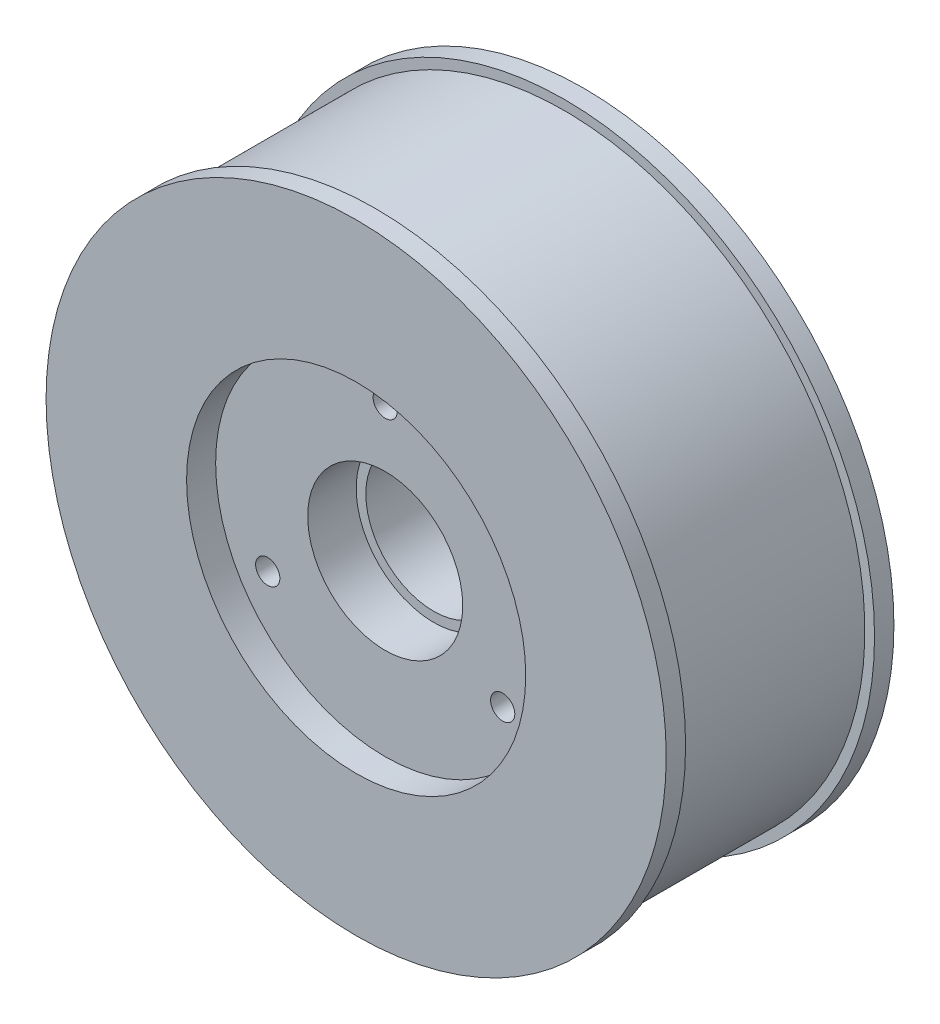
ISO-10303-21;
HEADER;
FILE_DESCRIPTION(('STEP AP214'),'2;1');
FILE_NAME('part.step','',(''),(''),'','','');
FILE_SCHEMA(('AUTOMOTIVE_DESIGN { 1 0 10303 214 1 1 1 1 }'));
ENDSEC;
DATA;
#1=APPLICATION_CONTEXT('core data for automotive mechanical design processes');
#2=APPLICATION_PROTOCOL_DEFINITION('international standard','automotive_design',2000,#1);
#3=PRODUCT_CONTEXT('',#1,'mechanical');
#4=PRODUCT('Part','Part','',(#3));
#5=PRODUCT_RELATED_PRODUCT_CATEGORY('part','',(#4));
#6=PRODUCT_DEFINITION_FORMATION('','',#4);
#7=PRODUCT_DEFINITION_CONTEXT('part definition',#1,'design');
#8=PRODUCT_DEFINITION('design','',#6,#7);
#9=PRODUCT_DEFINITION_SHAPE('','',#8);
#10=(LENGTH_UNIT() NAMED_UNIT(*) SI_UNIT(.MILLI.,.METRE.));
#11=(NAMED_UNIT(*) PLANE_ANGLE_UNIT() SI_UNIT($,.RADIAN.));
#12=(NAMED_UNIT(*) SI_UNIT($,.STERADIAN.) SOLID_ANGLE_UNIT());
#13=UNCERTAINTY_MEASURE_WITH_UNIT(LENGTH_MEASURE(1.E-05),#10,'distance_accuracy_value','');
#14=(GEOMETRIC_REPRESENTATION_CONTEXT(3) GLOBAL_UNCERTAINTY_ASSIGNED_CONTEXT((#13)) GLOBAL_UNIT_ASSIGNED_CONTEXT((#10,
#11,#12)) REPRESENTATION_CONTEXT('',''));
#15=CARTESIAN_POINT('',(0.,0.,0.));
#16=DIRECTION('',(0.,0.,1.));
#17=DIRECTION('',(1.,0.,0.));
#18=AXIS2_PLACEMENT_3D('',#15,#16,#17);
#19=CARTESIAN_POINT('',(-12.1243556529821,-7.00000000000006,3.));
#20=DIRECTION('',(0.,0.,-1.));
#21=DIRECTION('',(-1.,0.,0.));
#22=AXIS2_PLACEMENT_3D('',#19,#20,#21);
#23=CYLINDRICAL_SURFACE('',#22,1.24999999999999);
#24=CARTESIAN_POINT('',(-12.1243556529821,-7.00000000000006,3.));
#25=DIRECTION('',(0.,0.,-1.));
#26=DIRECTION('',(-1.,0.,0.));
#27=AXIS2_PLACEMENT_3D('',#24,#25,#26);
#28=CIRCLE('',#27,1.24999999999999);
#29=CARTESIAN_POINT('',(-13.3743556529821,-7.00000000000006,3.));
#30=VERTEX_POINT('',#29);
#31=EDGE_CURVE('E76',#30,#30,#28,.T.);
#32=ORIENTED_EDGE('',*,*,#31,.T.);
#33=EDGE_LOOP('',(#32));
#34=FACE_BOUND('',#33,.T.);
#35=CARTESIAN_POINT('',(-12.1243556529821,-7.00000000000006,18.5));
#36=DIRECTION('',(0.,0.,1.));
#37=DIRECTION('',(1.,0.,0.));
#38=AXIS2_PLACEMENT_3D('',#35,#36,#37);
#39=CIRCLE('',#38,1.24999999999999);
#40=CARTESIAN_POINT('',(-10.8743556529821,-7.00000000000006,18.5));
#41=VERTEX_POINT('',#40);
#42=EDGE_CURVE('E65',#41,#41,#39,.F.);
#43=ORIENTED_EDGE('',*,*,#42,.F.);
#44=EDGE_LOOP('',(#43));
#45=FACE_BOUND('',#44,.T.);
#46=ADVANCED_FACE('F30',(#34,#45),#23,.F.);
#47=CARTESIAN_POINT('',(12.1243556529822,-6.99999999999997,3.));
#48=DIRECTION('',(0.,0.,-1.));
#49=DIRECTION('',(-1.,0.,0.));
#50=AXIS2_PLACEMENT_3D('',#47,#48,#49);
#51=CYLINDRICAL_SURFACE('',#50,1.24999999999999);
#52=CARTESIAN_POINT('',(12.1243556529822,-6.99999999999997,3.));
#53=DIRECTION('',(0.,0.,-1.));
#54=DIRECTION('',(-1.,0.,0.));
#55=AXIS2_PLACEMENT_3D('',#52,#53,#54);
#56=CIRCLE('',#55,1.24999999999999);
#57=CARTESIAN_POINT('',(10.8743556529822,-6.99999999999997,3.));
#58=VERTEX_POINT('',#57);
#59=EDGE_CURVE('E62',#58,#58,#56,.T.);
#60=ORIENTED_EDGE('',*,*,#59,.T.);
#61=EDGE_LOOP('',(#60));
#62=FACE_BOUND('',#61,.T.);
#63=CARTESIAN_POINT('',(12.1243556529822,-6.99999999999997,18.5));
#64=DIRECTION('',(0.,0.,1.));
#65=DIRECTION('',(1.,0.,0.));
#66=AXIS2_PLACEMENT_3D('',#63,#64,#65);
#67=CIRCLE('',#66,1.24999999999999);
#68=CARTESIAN_POINT('',(13.3743556529821,-6.99999999999997,18.5));
#69=VERTEX_POINT('',#68);
#70=EDGE_CURVE('E70',#69,#69,#67,.F.);
#71=ORIENTED_EDGE('',*,*,#70,.F.);
#72=EDGE_LOOP('',(#71));
#73=FACE_BOUND('',#72,.T.);
#74=ADVANCED_FACE('F113',(#62,#73),#51,.F.);
#75=CARTESIAN_POINT('',(0.,14.,3.));
#76=DIRECTION('',(0.,0.,-1.));
#77=DIRECTION('',(-1.,0.,0.));
#78=AXIS2_PLACEMENT_3D('',#75,#76,#77);
#79=CYLINDRICAL_SURFACE('',#78,1.24999999999999);
#80=CARTESIAN_POINT('',(0.,14.,3.));
#81=DIRECTION('',(0.,0.,-1.));
#82=DIRECTION('',(-1.,0.,0.));
#83=AXIS2_PLACEMENT_3D('',#80,#81,#82);
#84=CIRCLE('',#83,1.24999999999999);
#85=CARTESIAN_POINT('',(-1.24999999999999,14.,3.));
#86=VERTEX_POINT('',#85);
#87=EDGE_CURVE('E57',#86,#86,#84,.T.);
#88=ORIENTED_EDGE('',*,*,#87,.T.);
#89=EDGE_LOOP('',(#88));
#90=FACE_BOUND('',#89,.T.);
#91=CARTESIAN_POINT('',(0.,14.,18.5));
#92=DIRECTION('',(0.,0.,1.));
#93=DIRECTION('',(1.,0.,0.));
#94=AXIS2_PLACEMENT_3D('',#91,#92,#93);
#95=CIRCLE('',#94,1.24999999999999);
#96=CARTESIAN_POINT('',(1.24999999999999,14.,18.5));
#97=VERTEX_POINT('',#96);
#98=EDGE_CURVE('E172',#97,#97,#95,.F.);
#99=ORIENTED_EDGE('',*,*,#98,.F.);
#100=EDGE_LOOP('',(#99));
#101=FACE_BOUND('',#100,.T.);
#102=ADVANCED_FACE('F119',(#90,#101),#79,.F.);
#103=CARTESIAN_POINT('',(0.,0.,13.5));
#104=DIRECTION('',(0.,0.,1.));
#105=DIRECTION('',(1.,0.,0.));
#106=AXIS2_PLACEMENT_3D('',#103,#104,#105);
#107=CYLINDRICAL_SURFACE('',#106,8.);
#108=CARTESIAN_POINT('',(0.,0.,13.5));
#109=DIRECTION('',(0.,0.,1.));
#110=DIRECTION('',(1.,0.,0.));
#111=AXIS2_PLACEMENT_3D('',#108,#109,#110);
#112=CIRCLE('',#111,8.);
#113=CARTESIAN_POINT('',(8.,0.,13.5));
#114=VERTEX_POINT('',#113);
#115=EDGE_CURVE('E58',#114,#114,#112,.T.);
#116=ORIENTED_EDGE('',*,*,#115,.F.);
#117=EDGE_LOOP('',(#116));
#118=FACE_BOUND('',#117,.T.);
#119=CARTESIAN_POINT('',(0.,0.,18.5));
#120=DIRECTION('',(0.,0.,1.));
#121=DIRECTION('',(1.,0.,0.));
#122=AXIS2_PLACEMENT_3D('',#119,#120,#121);
#123=CIRCLE('',#122,8.);
#124=CARTESIAN_POINT('',(8.,0.,18.5));
#125=VERTEX_POINT('',#124);
#126=EDGE_CURVE('E34',#125,#125,#123,.F.);
#127=ORIENTED_EDGE('',*,*,#126,.F.);
#128=EDGE_LOOP('',(#127));
#129=FACE_BOUND('',#128,.T.);
#130=ADVANCED_FACE('F146',(#118,#129),#107,.F.);
#131=CARTESIAN_POINT('',(0.,0.,21.5));
#132=DIRECTION('',(0.,0.,-1.));
#133=DIRECTION('',(-1.,0.,0.));
#134=AXIS2_PLACEMENT_3D('',#131,#132,#133);
#135=CYLINDRICAL_SURFACE('',#134,7.);
#136=CARTESIAN_POINT('',(0.,0.,7.5));
#137=DIRECTION('',(0.,0.,-1.));
#138=DIRECTION('',(-1.,0.,0.));
#139=AXIS2_PLACEMENT_3D('',#136,#137,#138);
#140=CIRCLE('',#139,7.);
#141=CARTESIAN_POINT('',(-7.,0.,7.5));
#142=VERTEX_POINT('',#141);
#143=EDGE_CURVE('E47',#142,#142,#140,.F.);
#144=ORIENTED_EDGE('',*,*,#143,.F.);
#145=EDGE_LOOP('',(#144));
#146=FACE_BOUND('',#145,.T.);
#147=CARTESIAN_POINT('',(0.,0.,13.5));
#148=DIRECTION('',(0.,0.,1.));
#149=DIRECTION('',(1.,0.,0.));
#150=AXIS2_PLACEMENT_3D('',#147,#148,#149);
#151=CIRCLE('',#150,7.);
#152=CARTESIAN_POINT('',(7.,0.,13.5));
#153=VERTEX_POINT('',#152);
#154=EDGE_CURVE('E55',#153,#153,#151,.F.);
#155=ORIENTED_EDGE('',*,*,#154,.F.);
#156=EDGE_LOOP('',(#155));
#157=FACE_BOUND('',#156,.T.);
#158=ADVANCED_FACE('F143',(#146,#157),#135,.F.);
#159=CARTESIAN_POINT('',(0.,0.,21.5));
#160=DIRECTION('',(0.,0.,1.));
#161=DIRECTION('',(1.,0.,0.));
#162=AXIS2_PLACEMENT_3D('',#159,#160,#161);
#163=PLANE('',#162);
#164=CARTESIAN_POINT('',(0.,0.,21.5));
#165=DIRECTION('',(0.,0.,1.));
#166=DIRECTION('',(1.,0.,0.));
#167=AXIS2_PLACEMENT_3D('',#164,#165,#166);
#168=CIRCLE('',#167,17.5);
#169=CARTESIAN_POINT('',(17.5,0.,21.5));
#170=VERTEX_POINT('',#169);
#171=EDGE_CURVE('E164',#170,#170,#168,.T.);
#172=ORIENTED_EDGE('',*,*,#171,.F.);
#173=EDGE_LOOP('',(#172));
#174=FACE_BOUND('',#173,.T.);
#175=CARTESIAN_POINT('',(0.,0.,21.5));
#176=DIRECTION('',(0.,0.,1.));
#177=DIRECTION('',(1.,0.,0.));
#178=AXIS2_PLACEMENT_3D('',#175,#176,#177);
#179=CIRCLE('',#178,32.);
#180=CARTESIAN_POINT('',(32.,0.,21.5));
#181=VERTEX_POINT('',#180);
#182=EDGE_CURVE('E38',#181,#181,#179,.T.);
#183=ORIENTED_EDGE('',*,*,#182,.T.);
#184=EDGE_LOOP('',(#183));
#185=FACE_BOUND('',#184,.T.);
#186=ADVANCED_FACE('F141',(#174,#185),#163,.T.);
#187=CARTESIAN_POINT('',(0.,0.,7.5));
#188=DIRECTION('',(0.,0.,-1.));
#189=DIRECTION('',(-1.,0.,0.));
#190=AXIS2_PLACEMENT_3D('',#187,#188,#189);
#191=CYLINDRICAL_SURFACE('',#190,8.);
#192=CARTESIAN_POINT('',(0.,0.,7.5));
#193=DIRECTION('',(0.,0.,-1.));
#194=DIRECTION('',(-1.,0.,0.));
#195=AXIS2_PLACEMENT_3D('',#192,#193,#194);
#196=CIRCLE('',#195,8.);
#197=CARTESIAN_POINT('',(-8.,0.,7.5));
#198=VERTEX_POINT('',#197);
#199=EDGE_CURVE('E51',#198,#198,#196,.T.);
#200=ORIENTED_EDGE('',*,*,#199,.F.);
#201=EDGE_LOOP('',(#200));
#202=FACE_BOUND('',#201,.T.);
#203=CARTESIAN_POINT('',(0.,0.,3.));
#204=DIRECTION('',(0.,0.,-1.));
#205=DIRECTION('',(-1.,0.,0.));
#206=AXIS2_PLACEMENT_3D('',#203,#204,#205);
#207=CIRCLE('',#206,8.);
#208=CARTESIAN_POINT('',(-8.,0.,3.));
#209=VERTEX_POINT('',#208);
#210=EDGE_CURVE('E52',#209,#209,#207,.F.);
#211=ORIENTED_EDGE('',*,*,#210,.F.);
#212=EDGE_LOOP('',(#211));
#213=FACE_BOUND('',#212,.T.);
#214=ADVANCED_FACE('F109',(#202,#213),#191,.F.);
#215=CARTESIAN_POINT('',(0.,0.,19.5));
#216=DIRECTION('',(0.,0.,-1.));
#217=DIRECTION('',(-1.,0.,0.));
#218=AXIS2_PLACEMENT_3D('',#215,#216,#217);
#219=CYLINDRICAL_SURFACE('',#218,31.);
#220=CARTESIAN_POINT('',(0.,0.,19.5));
#221=DIRECTION('',(0.,0.,1.));
#222=DIRECTION('',(1.,0.,0.));
#223=AXIS2_PLACEMENT_3D('',#220,#221,#222);
#224=CIRCLE('',#223,31.);
#225=CARTESIAN_POINT('',(31.,0.,19.5));
#226=VERTEX_POINT('',#225);
#227=EDGE_CURVE('E10',#226,#226,#224,.T.);
#228=ORIENTED_EDGE('',*,*,#227,.F.);
#229=EDGE_LOOP('',(#228));
#230=FACE_BOUND('',#229,.T.);
#231=CARTESIAN_POINT('',(0.,0.,0.));
#232=DIRECTION('',(0.,0.,-1.));
#233=DIRECTION('',(-1.,0.,0.));
#234=AXIS2_PLACEMENT_3D('',#231,#232,#233);
#235=CIRCLE('',#234,31.);
#236=CARTESIAN_POINT('',(-31.,0.,0.));
#237=VERTEX_POINT('',#236);
#238=EDGE_CURVE('E89',#237,#237,#235,.T.);
#239=ORIENTED_EDGE('',*,*,#238,.F.);
#240=EDGE_LOOP('',(#239));
#241=FACE_BOUND('',#240,.T.);
#242=ADVANCED_FACE('F32',(#230,#241),#219,.T.);
#243=CARTESIAN_POINT('',(0.,0.,19.5));
#244=DIRECTION('',(0.,0.,1.));
#245=DIRECTION('',(1.,0.,0.));
#246=AXIS2_PLACEMENT_3D('',#243,#244,#245);
#247=PLANE('',#246);
#248=CARTESIAN_POINT('',(0.,0.,19.5));
#249=DIRECTION('',(0.,0.,1.));
#250=DIRECTION('',(1.,0.,0.));
#251=AXIS2_PLACEMENT_3D('',#248,#249,#250);
#252=CIRCLE('',#251,32.);
#253=CARTESIAN_POINT('',(32.,0.,19.5));
#254=VERTEX_POINT('',#253);
#255=EDGE_CURVE('E43',#254,#254,#252,.T.);
#256=ORIENTED_EDGE('',*,*,#255,.F.);
#257=EDGE_LOOP('',(#256));
#258=FACE_BOUND('',#257,.T.);
#259=ORIENTED_EDGE('',*,*,#227,.T.);
#260=EDGE_LOOP('',(#259));
#261=FACE_BOUND('',#260,.T.);
#262=ADVANCED_FACE('F100',(#258,#261),#247,.F.);
#263=CARTESIAN_POINT('',(0.,0.,21.5));
#264=DIRECTION('',(0.,0.,-1.));
#265=DIRECTION('',(-1.,0.,0.));
#266=AXIS2_PLACEMENT_3D('',#263,#264,#265);
#267=CYLINDRICAL_SURFACE('',#266,32.);
#268=ORIENTED_EDGE('',*,*,#182,.F.);
#269=EDGE_LOOP('',(#268));
#270=FACE_BOUND('',#269,.T.);
#271=ORIENTED_EDGE('',*,*,#255,.T.);
#272=EDGE_LOOP('',(#271));
#273=FACE_BOUND('',#272,.T.);
#274=ADVANCED_FACE('F98',(#270,#273),#267,.T.);
#275=CARTESIAN_POINT('',(0.,0.,0.));
#276=DIRECTION('',(0.,0.,-1.));
#277=DIRECTION('',(-1.,0.,0.));
#278=AXIS2_PLACEMENT_3D('',#275,#276,#277);
#279=PLANE('',#278);
#280=CARTESIAN_POINT('',(0.,0.,0.));
#281=DIRECTION('',(0.,0.,-1.));
#282=DIRECTION('',(-1.,0.,0.));
#283=AXIS2_PLACEMENT_3D('',#280,#281,#282);
#284=CIRCLE('',#283,32.);
#285=CARTESIAN_POINT('',(-32.,0.,0.));
#286=VERTEX_POINT('',#285);
#287=EDGE_CURVE('E50',#286,#286,#284,.T.);
#288=ORIENTED_EDGE('',*,*,#287,.F.);
#289=EDGE_LOOP('',(#288));
#290=FACE_BOUND('',#289,.T.);
#291=ORIENTED_EDGE('',*,*,#238,.T.);
#292=EDGE_LOOP('',(#291));
#293=FACE_BOUND('',#292,.T.);
#294=ADVANCED_FACE('F107',(#290,#293),#279,.F.);
#295=CARTESIAN_POINT('',(0.,0.,-2.));
#296=DIRECTION('',(0.,0.,1.));
#297=DIRECTION('',(1.,0.,0.));
#298=AXIS2_PLACEMENT_3D('',#295,#296,#297);
#299=CYLINDRICAL_SURFACE('',#298,32.);
#300=CARTESIAN_POINT('',(0.,0.,-2.));
#301=DIRECTION('',(0.,0.,-1.));
#302=DIRECTION('',(-1.,0.,0.));
#303=AXIS2_PLACEMENT_3D('',#300,#301,#302);
#304=CIRCLE('',#303,32.);
#305=CARTESIAN_POINT('',(-32.,0.,-2.));
#306=VERTEX_POINT('',#305);
#307=EDGE_CURVE('E86',#306,#306,#304,.T.);
#308=ORIENTED_EDGE('',*,*,#307,.F.);
#309=EDGE_LOOP('',(#308));
#310=FACE_BOUND('',#309,.T.);
#311=ORIENTED_EDGE('',*,*,#287,.T.);
#312=EDGE_LOOP('',(#311));
#313=FACE_BOUND('',#312,.T.);
#314=ADVANCED_FACE('F150',(#310,#313),#299,.T.);
#315=CARTESIAN_POINT('',(0.,0.,-2.));
#316=DIRECTION('',(0.,0.,-1.));
#317=DIRECTION('',(-1.,0.,0.));
#318=AXIS2_PLACEMENT_3D('',#315,#316,#317);
#319=PLANE('',#318);
#320=CARTESIAN_POINT('',(0.,0.,-2.));
#321=DIRECTION('',(0.,0.,-1.));
#322=DIRECTION('',(-1.,0.,0.));
#323=AXIS2_PLACEMENT_3D('',#320,#321,#322);
#324=CIRCLE('',#323,18.);
#325=CARTESIAN_POINT('',(-18.,0.,-2.));
#326=VERTEX_POINT('',#325);
#327=EDGE_CURVE('E79',#326,#326,#324,.T.);
#328=ORIENTED_EDGE('',*,*,#327,.F.);
#329=EDGE_LOOP('',(#328));
#330=FACE_BOUND('',#329,.T.);
#331=ORIENTED_EDGE('',*,*,#307,.T.);
#332=EDGE_LOOP('',(#331));
#333=FACE_BOUND('',#332,.T.);
#334=ADVANCED_FACE('F137',(#330,#333),#319,.T.);
#335=CARTESIAN_POINT('',(0.,0.,7.5));
#336=DIRECTION('',(0.,0.,-1.));
#337=DIRECTION('',(-1.,0.,0.));
#338=AXIS2_PLACEMENT_3D('',#335,#336,#337);
#339=PLANE('',#338);
#340=ORIENTED_EDGE('',*,*,#199,.T.);
#341=EDGE_LOOP('',(#340));
#342=FACE_BOUND('',#341,.T.);
#343=ORIENTED_EDGE('',*,*,#143,.T.);
#344=EDGE_LOOP('',(#343));
#345=FACE_BOUND('',#344,.T.);
#346=ADVANCED_FACE('F129',(#342,#345),#339,.T.);
#347=CARTESIAN_POINT('',(0.,0.,3.));
#348=DIRECTION('',(0.,0.,-1.));
#349=DIRECTION('',(-1.,0.,0.));
#350=AXIS2_PLACEMENT_3D('',#347,#348,#349);
#351=PLANE('',#350);
#352=ORIENTED_EDGE('',*,*,#87,.F.);
#353=EDGE_LOOP('',(#352));
#354=FACE_BOUND('',#353,.T.);
#355=ORIENTED_EDGE('',*,*,#59,.F.);
#356=EDGE_LOOP('',(#355));
#357=FACE_BOUND('',#356,.T.);
#358=ORIENTED_EDGE('',*,*,#31,.F.);
#359=EDGE_LOOP('',(#358));
#360=FACE_BOUND('',#359,.T.);
#361=CARTESIAN_POINT('',(0.,0.,3.));
#362=DIRECTION('',(0.,0.,-1.));
#363=DIRECTION('',(-1.,0.,0.));
#364=AXIS2_PLACEMENT_3D('',#361,#362,#363);
#365=CIRCLE('',#364,18.);
#366=CARTESIAN_POINT('',(-18.,0.,3.));
#367=VERTEX_POINT('',#366);
#368=EDGE_CURVE('E54',#367,#367,#365,.T.);
#369=ORIENTED_EDGE('',*,*,#368,.T.);
#370=EDGE_LOOP('',(#369));
#371=FACE_BOUND('',#370,.T.);
#372=ORIENTED_EDGE('',*,*,#210,.T.);
#373=EDGE_LOOP('',(#372));
#374=FACE_BOUND('',#373,.T.);
#375=ADVANCED_FACE('F125',(#354,#357,#360,#371,#374),#351,.T.);
#376=CARTESIAN_POINT('',(0.,0.,3.));
#377=DIRECTION('',(0.,0.,-1.));
#378=DIRECTION('',(-1.,0.,0.));
#379=AXIS2_PLACEMENT_3D('',#376,#377,#378);
#380=CYLINDRICAL_SURFACE('',#379,18.);
#381=ORIENTED_EDGE('',*,*,#368,.F.);
#382=EDGE_LOOP('',(#381));
#383=FACE_BOUND('',#382,.T.);
#384=ORIENTED_EDGE('',*,*,#327,.T.);
#385=EDGE_LOOP('',(#384));
#386=FACE_BOUND('',#385,.T.);
#387=ADVANCED_FACE('F128',(#383,#386),#380,.F.);
#388=CARTESIAN_POINT('',(0.,0.,13.5));
#389=DIRECTION('',(0.,0.,1.));
#390=DIRECTION('',(1.,0.,0.));
#391=AXIS2_PLACEMENT_3D('',#388,#389,#390);
#392=PLANE('',#391);
#393=ORIENTED_EDGE('',*,*,#115,.T.);
#394=EDGE_LOOP('',(#393));
#395=FACE_BOUND('',#394,.T.);
#396=ORIENTED_EDGE('',*,*,#154,.T.);
#397=EDGE_LOOP('',(#396));
#398=FACE_BOUND('',#397,.T.);
#399=ADVANCED_FACE('F133',(#395,#398),#392,.T.);
#400=CARTESIAN_POINT('',(0.,0.,18.5));
#401=DIRECTION('',(0.,0.,1.));
#402=DIRECTION('',(1.,0.,0.));
#403=AXIS2_PLACEMENT_3D('',#400,#401,#402);
#404=PLANE('',#403);
#405=ORIENTED_EDGE('',*,*,#70,.T.);
#406=EDGE_LOOP('',(#405));
#407=FACE_BOUND('',#406,.T.);
#408=ORIENTED_EDGE('',*,*,#126,.T.);
#409=EDGE_LOOP('',(#408));
#410=FACE_BOUND('',#409,.T.);
#411=CARTESIAN_POINT('',(0.,0.,18.5));
#412=DIRECTION('',(0.,0.,1.));
#413=DIRECTION('',(1.,0.,0.));
#414=AXIS2_PLACEMENT_3D('',#411,#412,#413);
#415=CIRCLE('',#414,17.5);
#416=CARTESIAN_POINT('',(17.5,0.,18.5));
#417=VERTEX_POINT('',#416);
#418=EDGE_CURVE('E167',#417,#417,#415,.T.);
#419=ORIENTED_EDGE('',*,*,#418,.T.);
#420=EDGE_LOOP('',(#419));
#421=FACE_BOUND('',#420,.T.);
#422=ORIENTED_EDGE('',*,*,#98,.T.);
#423=EDGE_LOOP('',(#422));
#424=FACE_BOUND('',#423,.T.);
#425=ORIENTED_EDGE('',*,*,#42,.T.);
#426=EDGE_LOOP('',(#425));
#427=FACE_BOUND('',#426,.T.);
#428=ADVANCED_FACE('F177',(#407,#410,#421,#424,#427),#404,.T.);
#429=CARTESIAN_POINT('',(0.,0.,18.5));
#430=DIRECTION('',(0.,0.,1.));
#431=DIRECTION('',(1.,0.,0.));
#432=AXIS2_PLACEMENT_3D('',#429,#430,#431);
#433=CYLINDRICAL_SURFACE('',#432,17.5);
#434=ORIENTED_EDGE('',*,*,#418,.F.);
#435=EDGE_LOOP('',(#434));
#436=FACE_BOUND('',#435,.T.);
#437=ORIENTED_EDGE('',*,*,#171,.T.);
#438=EDGE_LOOP('',(#437));
#439=FACE_BOUND('',#438,.T.);
#440=ADVANCED_FACE('F181',(#436,#439),#433,.F.);
#441=CLOSED_SHELL('',(#46,#74,#102,#130,#158,#186,#214,#242,#262,#274,#294,#314,#334,#346,#375,
#387,#399,#428,#440));
#442=MANIFOLD_SOLID_BREP('B2',#441);
#443=ADVANCED_BREP_SHAPE_REPRESENTATION('',(#18,#442),#14);
#444=SHAPE_DEFINITION_REPRESENTATION(#9,#443);
ENDSEC;
END-ISO-10303-21;
